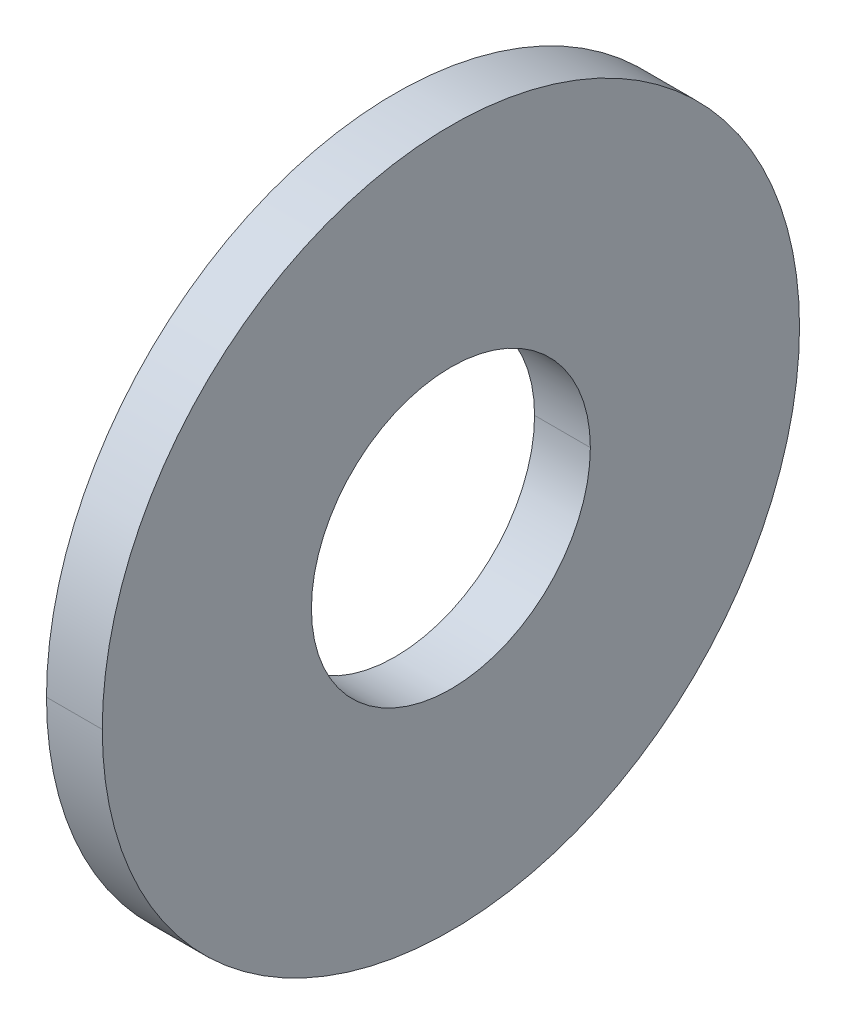
ISO-10303-21;
HEADER;
FILE_DESCRIPTION(('STEP AP214'),'2;1');
FILE_NAME('part.step','',(''),(''),'','','');
FILE_SCHEMA(('AUTOMOTIVE_DESIGN { 1 0 10303 214 1 1 1 1 }'));
ENDSEC;
DATA;
#1=APPLICATION_CONTEXT('core data for automotive mechanical design processes');
#2=APPLICATION_PROTOCOL_DEFINITION('international standard','automotive_design',2000,#1);
#3=PRODUCT_CONTEXT('',#1,'mechanical');
#4=PRODUCT('Part','Part','',(#3));
#5=PRODUCT_RELATED_PRODUCT_CATEGORY('part','',(#4));
#6=PRODUCT_DEFINITION_FORMATION('','',#4);
#7=PRODUCT_DEFINITION_CONTEXT('part definition',#1,'design');
#8=PRODUCT_DEFINITION('design','',#6,#7);
#9=PRODUCT_DEFINITION_SHAPE('','',#8);
#10=(LENGTH_UNIT() NAMED_UNIT(*) SI_UNIT(.MILLI.,.METRE.));
#11=(NAMED_UNIT(*) PLANE_ANGLE_UNIT() SI_UNIT($,.RADIAN.));
#12=(NAMED_UNIT(*) SI_UNIT($,.STERADIAN.) SOLID_ANGLE_UNIT());
#13=UNCERTAINTY_MEASURE_WITH_UNIT(LENGTH_MEASURE(1.E-05),#10,'distance_accuracy_value','');
#14=(GEOMETRIC_REPRESENTATION_CONTEXT(3) GLOBAL_UNCERTAINTY_ASSIGNED_CONTEXT((#13)) GLOBAL_UNIT_ASSIGNED_CONTEXT((#10,
#11,#12)) REPRESENTATION_CONTEXT('',''));
#15=CARTESIAN_POINT('',(0.,0.,0.));
#16=DIRECTION('',(0.,0.,1.));
#17=DIRECTION('',(1.,0.,0.));
#18=AXIS2_PLACEMENT_3D('',#15,#16,#17);
#19=CARTESIAN_POINT('',(0.4,0.,0.));
#20=DIRECTION('',(1.,0.,0.));
#21=DIRECTION('',(0.,1.,0.));
#22=AXIS2_PLACEMENT_3D('',#19,#20,#21);
#23=CYLINDRICAL_SURFACE('',#22,5.);
#24=DIRECTION('',(1.,0.,0.));
#25=VECTOR('',#24,1.);
#26=CARTESIAN_POINT('',(-0.4,0.,5.));
#27=LINE('',#26,#25);
#28=CARTESIAN_POINT('',(-0.4,0.,5.));
#29=VERTEX_POINT('',#28);
#30=CARTESIAN_POINT('',(0.4,0.,5.));
#31=VERTEX_POINT('',#30);
#32=EDGE_CURVE('E11',#29,#31,#27,.T.);
#33=ORIENTED_EDGE('',*,*,#32,.F.);
#34=CARTESIAN_POINT('',(-0.4,0.,0.));
#35=DIRECTION('',(1.,0.,0.));
#36=DIRECTION('',(0.,0.,-1.));
#37=AXIS2_PLACEMENT_3D('',#34,#35,#36);
#38=CIRCLE('',#37,5.);
#39=CARTESIAN_POINT('',(-0.4,0.,-5.));
#40=VERTEX_POINT('',#39);
#41=EDGE_CURVE('E25',#29,#40,#38,.T.);
#42=ORIENTED_EDGE('',*,*,#41,.T.);
#43=DIRECTION('',(1.,0.,0.));
#44=VECTOR('',#43,1.);
#45=CARTESIAN_POINT('',(-0.4,0.,-5.));
#46=LINE('',#45,#44);
#47=CARTESIAN_POINT('',(0.4,0.,-5.));
#48=VERTEX_POINT('',#47);
#49=EDGE_CURVE('E103',#40,#48,#46,.T.);
#50=ORIENTED_EDGE('',*,*,#49,.T.);
#51=CARTESIAN_POINT('',(0.4,0.,0.));
#52=DIRECTION('',(1.,0.,0.));
#53=DIRECTION('',(0.,0.,-1.));
#54=AXIS2_PLACEMENT_3D('',#51,#52,#53);
#55=CIRCLE('',#54,5.);
#56=EDGE_CURVE('E98',#31,#48,#55,.T.);
#57=ORIENTED_EDGE('',*,*,#56,.F.);
#58=EDGE_LOOP('',(#33,#42,#50,#57));
#59=FACE_BOUND('',#58,.T.);
#60=ADVANCED_FACE('F17',(#59),#23,.T.);
#61=CARTESIAN_POINT('',(0.4,2.,0.));
#62=DIRECTION('',(1.,0.,0.));
#63=DIRECTION('',(0.,0.,-1.));
#64=AXIS2_PLACEMENT_3D('',#61,#62,#63);
#65=PLANE('',#64);
#66=CARTESIAN_POINT('',(0.4,0.,0.));
#67=DIRECTION('',(1.,0.,0.));
#68=DIRECTION('',(0.,0.,-1.));
#69=AXIS2_PLACEMENT_3D('',#66,#67,#68);
#70=CIRCLE('',#69,5.);
#71=EDGE_CURVE('E93',#48,#31,#70,.T.);
#72=ORIENTED_EDGE('',*,*,#71,.T.);
#73=ORIENTED_EDGE('',*,*,#56,.T.);
#74=EDGE_LOOP('',(#72,#73));
#75=FACE_BOUND('',#74,.T.);
#76=CARTESIAN_POINT('',(0.4,0.,0.));
#77=DIRECTION('',(1.,0.,0.));
#78=DIRECTION('',(0.,0.,-1.));
#79=AXIS2_PLACEMENT_3D('',#76,#77,#78);
#80=CIRCLE('',#79,2.);
#81=CARTESIAN_POINT('',(0.4,0.,2.));
#82=VERTEX_POINT('',#81);
#83=CARTESIAN_POINT('',(0.4,0.,-2.));
#84=VERTEX_POINT('',#83);
#85=EDGE_CURVE('E69',#82,#84,#80,.T.);
#86=ORIENTED_EDGE('',*,*,#85,.F.);
#87=CARTESIAN_POINT('',(0.4,0.,0.));
#88=DIRECTION('',(1.,0.,0.));
#89=DIRECTION('',(0.,0.,-1.));
#90=AXIS2_PLACEMENT_3D('',#87,#88,#89);
#91=CIRCLE('',#90,2.);
#92=EDGE_CURVE('E86',#84,#82,#91,.T.);
#93=ORIENTED_EDGE('',*,*,#92,.F.);
#94=EDGE_LOOP('',(#86,#93));
#95=FACE_BOUND('',#94,.T.);
#96=ADVANCED_FACE('F116',(#75,#95),#65,.T.);
#97=CARTESIAN_POINT('',(0.4,0.,0.));
#98=DIRECTION('',(1.,0.,0.));
#99=DIRECTION('',(0.,-1.,0.));
#100=AXIS2_PLACEMENT_3D('',#97,#98,#99);
#101=CYLINDRICAL_SURFACE('',#100,2.);
#102=DIRECTION('',(1.,0.,0.));
#103=VECTOR('',#102,1.);
#104=CARTESIAN_POINT('',(-0.4,0.,2.));
#105=LINE('',#104,#103);
#106=CARTESIAN_POINT('',(-0.4,0.,2.));
#107=VERTEX_POINT('',#106);
#108=EDGE_CURVE('E61',#107,#82,#105,.T.);
#109=ORIENTED_EDGE('',*,*,#108,.F.);
#110=CARTESIAN_POINT('',(-0.4,0.,0.));
#111=DIRECTION('',(1.,0.,0.));
#112=DIRECTION('',(0.,0.,-1.));
#113=AXIS2_PLACEMENT_3D('',#110,#111,#112);
#114=CIRCLE('',#113,2.);
#115=CARTESIAN_POINT('',(-0.4,0.,-2.));
#116=VERTEX_POINT('',#115);
#117=EDGE_CURVE('E54',#116,#107,#114,.T.);
#118=ORIENTED_EDGE('',*,*,#117,.F.);
#119=DIRECTION('',(1.,0.,0.));
#120=VECTOR('',#119,1.);
#121=CARTESIAN_POINT('',(-0.4,0.,-2.));
#122=LINE('',#121,#120);
#123=EDGE_CURVE('E58',#116,#84,#122,.T.);
#124=ORIENTED_EDGE('',*,*,#123,.T.);
#125=ORIENTED_EDGE('',*,*,#92,.T.);
#126=EDGE_LOOP('',(#109,#118,#124,#125));
#127=FACE_BOUND('',#126,.T.);
#128=ADVANCED_FACE('F56',(#127),#101,.F.);
#129=CARTESIAN_POINT('',(0.4,0.,0.));
#130=DIRECTION('',(1.,0.,0.));
#131=DIRECTION('',(0.,1.,0.));
#132=AXIS2_PLACEMENT_3D('',#129,#130,#131);
#133=CYLINDRICAL_SURFACE('',#132,2.);
#134=ORIENTED_EDGE('',*,*,#108,.T.);
#135=ORIENTED_EDGE('',*,*,#85,.T.);
#136=ORIENTED_EDGE('',*,*,#123,.F.);
#137=CARTESIAN_POINT('',(-0.4,0.,0.));
#138=DIRECTION('',(1.,0.,0.));
#139=DIRECTION('',(0.,0.,-1.));
#140=AXIS2_PLACEMENT_3D('',#137,#138,#139);
#141=CIRCLE('',#140,2.);
#142=EDGE_CURVE('E68',#107,#116,#141,.T.);
#143=ORIENTED_EDGE('',*,*,#142,.F.);
#144=EDGE_LOOP('',(#134,#135,#136,#143));
#145=FACE_BOUND('',#144,.T.);
#146=ADVANCED_FACE('F67',(#145),#133,.F.);
#147=CARTESIAN_POINT('',(-0.4,5.,0.));
#148=DIRECTION('',(-1.,0.,0.));
#149=DIRECTION('',(0.,0.,1.));
#150=AXIS2_PLACEMENT_3D('',#147,#148,#149);
#151=PLANE('',#150);
#152=ORIENTED_EDGE('',*,*,#117,.T.);
#153=ORIENTED_EDGE('',*,*,#142,.T.);
#154=EDGE_LOOP('',(#152,#153));
#155=FACE_BOUND('',#154,.T.);
#156=ORIENTED_EDGE('',*,*,#41,.F.);
#157=CARTESIAN_POINT('',(-0.4,0.,0.));
#158=DIRECTION('',(1.,0.,0.));
#159=DIRECTION('',(0.,0.,-1.));
#160=AXIS2_PLACEMENT_3D('',#157,#158,#159);
#161=CIRCLE('',#160,5.);
#162=EDGE_CURVE('E73',#40,#29,#161,.T.);
#163=ORIENTED_EDGE('',*,*,#162,.F.);
#164=EDGE_LOOP('',(#156,#163));
#165=FACE_BOUND('',#164,.T.);
#166=ADVANCED_FACE('F71',(#155,#165),#151,.T.);
#167=CARTESIAN_POINT('',(0.4,0.,0.));
#168=DIRECTION('',(1.,0.,0.));
#169=DIRECTION('',(0.,-1.,0.));
#170=AXIS2_PLACEMENT_3D('',#167,#168,#169);
#171=CYLINDRICAL_SURFACE('',#170,5.);
#172=ORIENTED_EDGE('',*,*,#32,.T.);
#173=ORIENTED_EDGE('',*,*,#71,.F.);
#174=ORIENTED_EDGE('',*,*,#49,.F.);
#175=ORIENTED_EDGE('',*,*,#162,.T.);
#176=EDGE_LOOP('',(#172,#173,#174,#175));
#177=FACE_BOUND('',#176,.T.);
#178=ADVANCED_FACE('F114',(#177),#171,.T.);
#179=CLOSED_SHELL('',(#60,#96,#128,#146,#166,#178));
#180=MANIFOLD_SOLID_BREP('B1',#179);
#181=ADVANCED_BREP_SHAPE_REPRESENTATION('',(#18,#180),#14);
#182=SHAPE_DEFINITION_REPRESENTATION(#9,#181);
ENDSEC;
END-ISO-10303-21;
